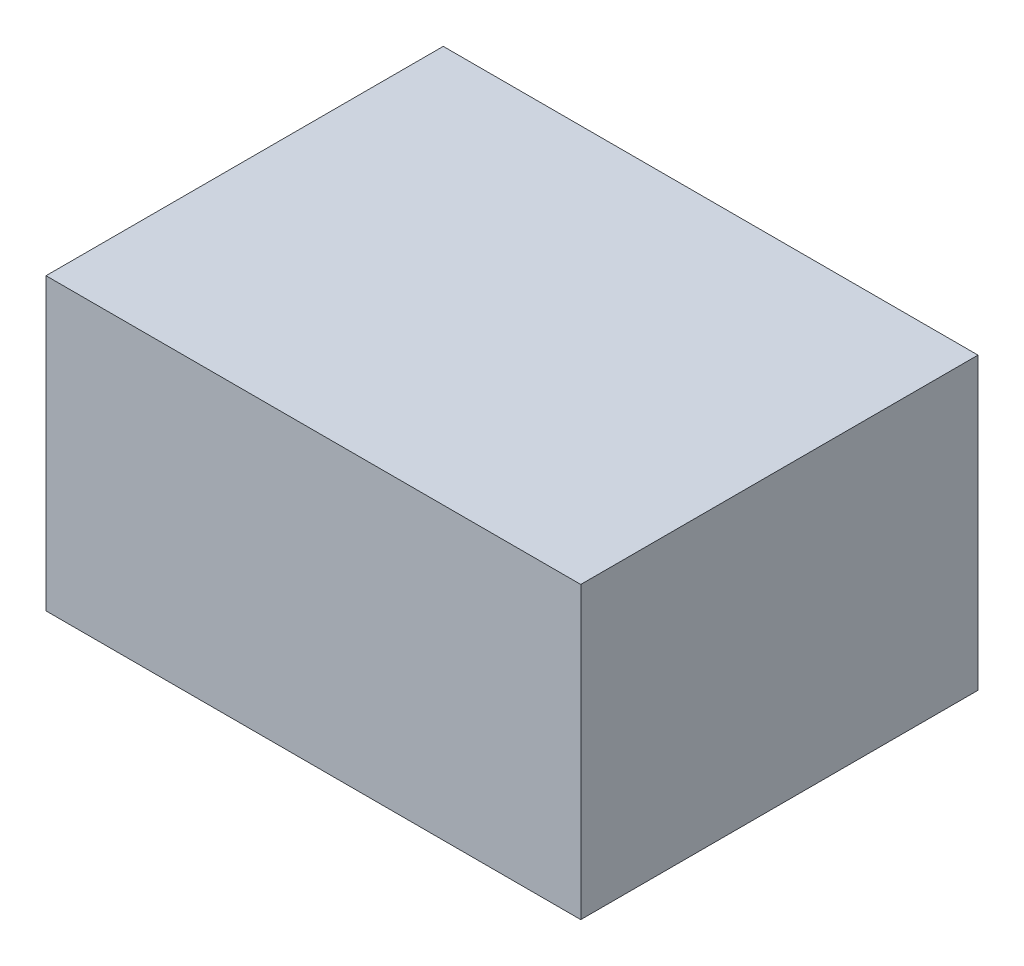
ISO-10303-21;
HEADER;
FILE_DESCRIPTION(('STEP AP214'),'2;1');
FILE_NAME('part.step','',(''),(''),'','','');
FILE_SCHEMA(('AUTOMOTIVE_DESIGN { 1 0 10303 214 1 1 1 1 }'));
ENDSEC;
DATA;
#1=APPLICATION_CONTEXT('core data for automotive mechanical design processes');
#2=APPLICATION_PROTOCOL_DEFINITION('international standard','automotive_design',2000,#1);
#3=PRODUCT_CONTEXT('',#1,'mechanical');
#4=PRODUCT('Part','Part','',(#3));
#5=PRODUCT_RELATED_PRODUCT_CATEGORY('part','',(#4));
#6=PRODUCT_DEFINITION_FORMATION('','',#4);
#7=PRODUCT_DEFINITION_CONTEXT('part definition',#1,'design');
#8=PRODUCT_DEFINITION('design','',#6,#7);
#9=PRODUCT_DEFINITION_SHAPE('','',#8);
#10=(LENGTH_UNIT() NAMED_UNIT(*) SI_UNIT(.MILLI.,.METRE.));
#11=(NAMED_UNIT(*) PLANE_ANGLE_UNIT() SI_UNIT($,.RADIAN.));
#12=(NAMED_UNIT(*) SI_UNIT($,.STERADIAN.) SOLID_ANGLE_UNIT());
#13=UNCERTAINTY_MEASURE_WITH_UNIT(LENGTH_MEASURE(1.E-05),#10,'distance_accuracy_value','');
#14=(GEOMETRIC_REPRESENTATION_CONTEXT(3) GLOBAL_UNCERTAINTY_ASSIGNED_CONTEXT((#13)) GLOBAL_UNIT_ASSIGNED_CONTEXT((#10,
#11,#12)) REPRESENTATION_CONTEXT('',''));
#15=CARTESIAN_POINT('',(0.,0.,0.));
#16=DIRECTION('',(0.,0.,1.));
#17=DIRECTION('',(1.,0.,0.));
#18=AXIS2_PLACEMENT_3D('',#15,#16,#17);
#19=CARTESIAN_POINT('',(0.87499952,0.47500032,0.));
#20=DIRECTION('',(0.,-1.,0.));
#21=DIRECTION('',(0.,0.,-1.));
#22=AXIS2_PLACEMENT_3D('',#19,#20,#21);
#23=PLANE('',#22);
#24=DIRECTION('',(0.,0.,-1.));
#25=VECTOR('',#24,1.);
#26=CARTESIAN_POINT('',(-0.87499952,0.47500032,0.));
#27=LINE('',#26,#25);
#28=CARTESIAN_POINT('',(-0.87499952,0.47500032,0.));
#29=VERTEX_POINT('',#28);
#30=CARTESIAN_POINT('',(-0.87499952,0.47500032,1.29999994));
#31=VERTEX_POINT('',#30);
#32=EDGE_CURVE('E19',#29,#31,#27,.F.);
#33=ORIENTED_EDGE('',*,*,#32,.T.);
#34=DIRECTION('',(-1.,0.,0.));
#35=VECTOR('',#34,1.);
#36=CARTESIAN_POINT('',(-0.87499952,0.47500032,1.29999994));
#37=LINE('',#36,#35);
#38=CARTESIAN_POINT('',(0.87499952,0.47500032,1.29999994));
#39=VERTEX_POINT('',#38);
#40=EDGE_CURVE('E54',#31,#39,#37,.F.);
#41=ORIENTED_EDGE('',*,*,#40,.T.);
#42=DIRECTION('',(0.,0.,1.));
#43=VECTOR('',#42,1.);
#44=CARTESIAN_POINT('',(0.87499952,0.47500032,0.));
#45=LINE('',#44,#43);
#46=CARTESIAN_POINT('',(0.87499952,0.47500032,0.));
#47=VERTEX_POINT('',#46);
#48=EDGE_CURVE('E75',#39,#47,#45,.F.);
#49=ORIENTED_EDGE('',*,*,#48,.T.);
#50=DIRECTION('',(-1.,0.,0.));
#51=VECTOR('',#50,1.);
#52=CARTESIAN_POINT('',(-0.87499952,0.47500032,0.));
#53=LINE('',#52,#51);
#54=EDGE_CURVE('E57',#29,#47,#53,.F.);
#55=ORIENTED_EDGE('',*,*,#54,.F.);
#56=EDGE_LOOP('',(#33,#41,#49,#55));
#57=FACE_BOUND('',#56,.T.);
#58=ADVANCED_FACE('F16',(#57),#23,.F.);
#59=CARTESIAN_POINT('',(-0.87499952,0.47500032,0.));
#60=DIRECTION('',(1.,0.,0.));
#61=DIRECTION('',(0.,0.,-1.));
#62=AXIS2_PLACEMENT_3D('',#59,#60,#61);
#63=PLANE('',#62);
#64=DIRECTION('',(0.,0.,1.));
#65=VECTOR('',#64,1.);
#66=CARTESIAN_POINT('',(-0.87499952,-0.47500032,0.));
#67=LINE('',#66,#65);
#68=CARTESIAN_POINT('',(-0.87499952,-0.47500032,0.));
#69=VERTEX_POINT('',#68);
#70=CARTESIAN_POINT('',(-0.87499952,-0.47500032,1.29999994));
#71=VERTEX_POINT('',#70);
#72=EDGE_CURVE('E72',#69,#71,#67,.T.);
#73=ORIENTED_EDGE('',*,*,#72,.T.);
#74=DIRECTION('',(0.,1.,0.));
#75=VECTOR('',#74,1.);
#76=CARTESIAN_POINT('',(-0.87499952,-0.47500032,1.29999994));
#77=LINE('',#76,#75);
#78=EDGE_CURVE('E62',#71,#31,#77,.T.);
#79=ORIENTED_EDGE('',*,*,#78,.T.);
#80=ORIENTED_EDGE('',*,*,#32,.F.);
#81=DIRECTION('',(0.,1.,0.));
#82=VECTOR('',#81,1.);
#83=CARTESIAN_POINT('',(-0.87499952,-0.47500032,0.));
#84=LINE('',#83,#82);
#85=EDGE_CURVE('E77',#69,#29,#84,.T.);
#86=ORIENTED_EDGE('',*,*,#85,.F.);
#87=EDGE_LOOP('',(#73,#79,#80,#86));
#88=FACE_BOUND('',#87,.T.);
#89=ADVANCED_FACE('F71',(#88),#63,.F.);
#90=CARTESIAN_POINT('',(-0.87499952,-0.47500032,1.29999994));
#91=DIRECTION('',(0.,0.,-1.));
#92=DIRECTION('',(-1.,0.,0.));
#93=AXIS2_PLACEMENT_3D('',#90,#91,#92);
#94=PLANE('',#93);
#95=DIRECTION('',(0.,1.,0.));
#96=VECTOR('',#95,1.);
#97=CARTESIAN_POINT('',(0.87499952,-0.47500032,1.29999994));
#98=LINE('',#97,#96);
#99=CARTESIAN_POINT('',(0.87499952,-0.47500032,1.29999994));
#100=VERTEX_POINT('',#99);
#101=EDGE_CURVE('E68',#100,#39,#98,.T.);
#102=ORIENTED_EDGE('',*,*,#101,.T.);
#103=ORIENTED_EDGE('',*,*,#40,.F.);
#104=ORIENTED_EDGE('',*,*,#78,.F.);
#105=DIRECTION('',(1.,0.,0.));
#106=VECTOR('',#105,1.);
#107=CARTESIAN_POINT('',(-0.87499952,-0.47500032,1.29999994));
#108=LINE('',#107,#106);
#109=EDGE_CURVE('E82',#71,#100,#108,.T.);
#110=ORIENTED_EDGE('',*,*,#109,.T.);
#111=EDGE_LOOP('',(#102,#103,#104,#110));
#112=FACE_BOUND('',#111,.T.);
#113=ADVANCED_FACE('F65',(#112),#94,.F.);
#114=CARTESIAN_POINT('',(0.87499952,-0.47500032,0.));
#115=DIRECTION('',(-1.,0.,0.));
#116=DIRECTION('',(0.,0.,1.));
#117=AXIS2_PLACEMENT_3D('',#114,#115,#116);
#118=PLANE('',#117);
#119=ORIENTED_EDGE('',*,*,#48,.F.);
#120=ORIENTED_EDGE('',*,*,#101,.F.);
#121=DIRECTION('',(0.,0.,1.));
#122=VECTOR('',#121,1.);
#123=CARTESIAN_POINT('',(0.87499952,-0.47500032,0.));
#124=LINE('',#123,#122);
#125=CARTESIAN_POINT('',(0.87499952,-0.47500032,0.));
#126=VERTEX_POINT('',#125);
#127=EDGE_CURVE('E25',#100,#126,#124,.F.);
#128=ORIENTED_EDGE('',*,*,#127,.T.);
#129=DIRECTION('',(0.,1.,0.));
#130=VECTOR('',#129,1.);
#131=CARTESIAN_POINT('',(0.87499952,-0.47500032,0.));
#132=LINE('',#131,#130);
#133=EDGE_CURVE('E33',#47,#126,#132,.F.);
#134=ORIENTED_EDGE('',*,*,#133,.F.);
#135=EDGE_LOOP('',(#119,#120,#128,#134));
#136=FACE_BOUND('',#135,.T.);
#137=ADVANCED_FACE('F87',(#136),#118,.F.);
#138=CARTESIAN_POINT('',(-0.87499952,-0.47500032,0.));
#139=DIRECTION('',(0.,0.,-1.));
#140=DIRECTION('',(-1.,0.,0.));
#141=AXIS2_PLACEMENT_3D('',#138,#139,#140);
#142=PLANE('',#141);
#143=ORIENTED_EDGE('',*,*,#133,.T.);
#144=DIRECTION('',(1.,0.,0.));
#145=VECTOR('',#144,1.);
#146=CARTESIAN_POINT('',(-0.87499952,-0.47500032,0.));
#147=LINE('',#146,#145);
#148=EDGE_CURVE('E10',#126,#69,#147,.F.);
#149=ORIENTED_EDGE('',*,*,#148,.T.);
#150=ORIENTED_EDGE('',*,*,#85,.T.);
#151=ORIENTED_EDGE('',*,*,#54,.T.);
#152=EDGE_LOOP('',(#143,#149,#150,#151));
#153=FACE_BOUND('',#152,.T.);
#154=ADVANCED_FACE('F90',(#153),#142,.T.);
#155=CARTESIAN_POINT('',(-0.87499952,-0.47500032,0.));
#156=DIRECTION('',(0.,1.,0.));
#157=DIRECTION('',(0.,0.,1.));
#158=AXIS2_PLACEMENT_3D('',#155,#156,#157);
#159=PLANE('',#158);
#160=ORIENTED_EDGE('',*,*,#127,.F.);
#161=ORIENTED_EDGE('',*,*,#109,.F.);
#162=ORIENTED_EDGE('',*,*,#72,.F.);
#163=ORIENTED_EDGE('',*,*,#148,.F.);
#164=EDGE_LOOP('',(#160,#161,#162,#163));
#165=FACE_BOUND('',#164,.T.);
#166=ADVANCED_FACE('F89',(#165),#159,.F.);
#167=CLOSED_SHELL('',(#58,#89,#113,#137,#154,#166));
#168=MANIFOLD_SOLID_BREP('B1',#167);
#169=ADVANCED_BREP_SHAPE_REPRESENTATION('',(#18,#168),#14);
#170=SHAPE_DEFINITION_REPRESENTATION(#9,#169);
ENDSEC;
END-ISO-10303-21;
